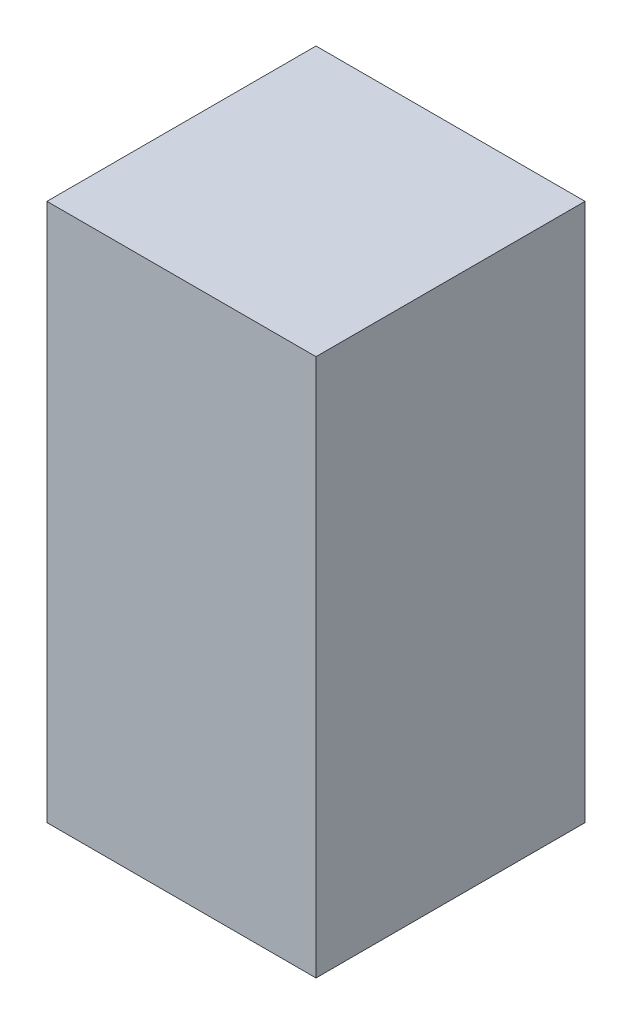
ISO-10303-21;
HEADER;
FILE_DESCRIPTION(('STEP AP214'),'2;1');
FILE_NAME('part.step','',(''),(''),'','','');
FILE_SCHEMA(('AUTOMOTIVE_DESIGN { 1 0 10303 214 1 1 1 1 }'));
ENDSEC;
DATA;
#1=APPLICATION_CONTEXT('core data for automotive mechanical design processes');
#2=APPLICATION_PROTOCOL_DEFINITION('international standard','automotive_design',2000,#1);
#3=PRODUCT_CONTEXT('',#1,'mechanical');
#4=PRODUCT('Part','Part','',(#3));
#5=PRODUCT_RELATED_PRODUCT_CATEGORY('part','',(#4));
#6=PRODUCT_DEFINITION_FORMATION('','',#4);
#7=PRODUCT_DEFINITION_CONTEXT('part definition',#1,'design');
#8=PRODUCT_DEFINITION('design','',#6,#7);
#9=PRODUCT_DEFINITION_SHAPE('','',#8);
#10=(LENGTH_UNIT() NAMED_UNIT(*) SI_UNIT(.MILLI.,.METRE.));
#11=(NAMED_UNIT(*) PLANE_ANGLE_UNIT() SI_UNIT($,.RADIAN.));
#12=(NAMED_UNIT(*) SI_UNIT($,.STERADIAN.) SOLID_ANGLE_UNIT());
#13=UNCERTAINTY_MEASURE_WITH_UNIT(LENGTH_MEASURE(1.E-05),#10,'distance_accuracy_value','');
#14=(GEOMETRIC_REPRESENTATION_CONTEXT(3) GLOBAL_UNCERTAINTY_ASSIGNED_CONTEXT((#13)) GLOBAL_UNIT_ASSIGNED_CONTEXT((#10,
#11,#12)) REPRESENTATION_CONTEXT('',''));
#15=CARTESIAN_POINT('',(0.,0.,0.));
#16=DIRECTION('',(0.,0.,1.));
#17=DIRECTION('',(1.,0.,0.));
#18=AXIS2_PLACEMENT_3D('',#15,#16,#17);
#19=CARTESIAN_POINT('',(0.,400.,0.));
#20=DIRECTION('',(1.,0.,0.));
#21=DIRECTION('',(0.,0.,-1.));
#22=AXIS2_PLACEMENT_3D('',#19,#20,#21);
#23=PLANE('',#22);
#24=DIRECTION('',(0.,0.,1.));
#25=VECTOR('',#24,1.);
#26=CARTESIAN_POINT('',(0.,0.,0.));
#27=LINE('',#26,#25);
#28=CARTESIAN_POINT('',(0.,0.,0.));
#29=VERTEX_POINT('',#28);
#30=CARTESIAN_POINT('',(0.,0.,200.));
#31=VERTEX_POINT('',#30);
#32=EDGE_CURVE('E96',#29,#31,#27,.T.);
#33=ORIENTED_EDGE('',*,*,#32,.T.);
#34=DIRECTION('',(0.,-1.,0.));
#35=VECTOR('',#34,1.);
#36=CARTESIAN_POINT('',(0.,400.,200.));
#37=LINE('',#36,#35);
#38=CARTESIAN_POINT('',(0.,400.,200.));
#39=VERTEX_POINT('',#38);
#40=EDGE_CURVE('E11',#39,#31,#37,.T.);
#41=ORIENTED_EDGE('',*,*,#40,.F.);
#42=DIRECTION('',(0.,0.,1.));
#43=VECTOR('',#42,1.);
#44=CARTESIAN_POINT('',(0.,400.,0.));
#45=LINE('',#44,#43);
#46=CARTESIAN_POINT('',(0.,400.,0.));
#47=VERTEX_POINT('',#46);
#48=EDGE_CURVE('E84',#47,#39,#45,.T.);
#49=ORIENTED_EDGE('',*,*,#48,.F.);
#50=DIRECTION('',(0.,-1.,0.));
#51=VECTOR('',#50,1.);
#52=CARTESIAN_POINT('',(0.,400.,0.));
#53=LINE('',#52,#51);
#54=EDGE_CURVE('E92',#47,#29,#53,.T.);
#55=ORIENTED_EDGE('',*,*,#54,.T.);
#56=EDGE_LOOP('',(#33,#41,#49,#55));
#57=FACE_BOUND('',#56,.T.);
#58=ADVANCED_FACE('F33',(#57),#23,.F.);
#59=CARTESIAN_POINT('',(0.,400.,200.));
#60=DIRECTION('',(0.,0.,-1.));
#61=DIRECTION('',(-1.,0.,0.));
#62=AXIS2_PLACEMENT_3D('',#59,#60,#61);
#63=PLANE('',#62);
#64=DIRECTION('',(1.,0.,0.));
#65=VECTOR('',#64,1.);
#66=CARTESIAN_POINT('',(0.,0.,200.));
#67=LINE('',#66,#65);
#68=CARTESIAN_POINT('',(200.,0.,200.));
#69=VERTEX_POINT('',#68);
#70=EDGE_CURVE('E88',#31,#69,#67,.T.);
#71=ORIENTED_EDGE('',*,*,#70,.T.);
#72=DIRECTION('',(0.,-1.,0.));
#73=VECTOR('',#72,1.);
#74=CARTESIAN_POINT('',(200.,400.,200.));
#75=LINE('',#74,#73);
#76=CARTESIAN_POINT('',(200.,400.,200.));
#77=VERTEX_POINT('',#76);
#78=EDGE_CURVE('E41',#77,#69,#75,.T.);
#79=ORIENTED_EDGE('',*,*,#78,.F.);
#80=DIRECTION('',(1.,0.,0.));
#81=VECTOR('',#80,1.);
#82=CARTESIAN_POINT('',(0.,400.,200.));
#83=LINE('',#82,#81);
#84=EDGE_CURVE('E79',#39,#77,#83,.T.);
#85=ORIENTED_EDGE('',*,*,#84,.F.);
#86=ORIENTED_EDGE('',*,*,#40,.T.);
#87=EDGE_LOOP('',(#71,#79,#85,#86));
#88=FACE_BOUND('',#87,.T.);
#89=ADVANCED_FACE('F87',(#88),#63,.F.);
#90=CARTESIAN_POINT('',(200.,400.,0.));
#91=DIRECTION('',(-1.,0.,0.));
#92=DIRECTION('',(0.,0.,1.));
#93=AXIS2_PLACEMENT_3D('',#90,#91,#92);
#94=PLANE('',#93);
#95=DIRECTION('',(0.,0.,-1.));
#96=VECTOR('',#95,1.);
#97=CARTESIAN_POINT('',(200.,0.,0.));
#98=LINE('',#97,#96);
#99=CARTESIAN_POINT('',(200.,0.,0.));
#100=VERTEX_POINT('',#99);
#101=EDGE_CURVE('E66',#69,#100,#98,.T.);
#102=ORIENTED_EDGE('',*,*,#101,.T.);
#103=DIRECTION('',(0.,-1.,0.));
#104=VECTOR('',#103,1.);
#105=CARTESIAN_POINT('',(200.,400.,0.));
#106=LINE('',#105,#104);
#107=CARTESIAN_POINT('',(200.,400.,0.));
#108=VERTEX_POINT('',#107);
#109=EDGE_CURVE('E89',#108,#100,#106,.T.);
#110=ORIENTED_EDGE('',*,*,#109,.F.);
#111=DIRECTION('',(0.,0.,-1.));
#112=VECTOR('',#111,1.);
#113=CARTESIAN_POINT('',(200.,400.,0.));
#114=LINE('',#113,#112);
#115=EDGE_CURVE('E82',#77,#108,#114,.T.);
#116=ORIENTED_EDGE('',*,*,#115,.F.);
#117=ORIENTED_EDGE('',*,*,#78,.T.);
#118=EDGE_LOOP('',(#102,#110,#116,#117));
#119=FACE_BOUND('',#118,.T.);
#120=ADVANCED_FACE('F90',(#119),#94,.F.);
#121=CARTESIAN_POINT('',(0.,400.,0.));
#122=DIRECTION('',(0.,0.,1.));
#123=DIRECTION('',(1.,0.,0.));
#124=AXIS2_PLACEMENT_3D('',#121,#122,#123);
#125=PLANE('',#124);
#126=DIRECTION('',(-1.,0.,0.));
#127=VECTOR('',#126,1.);
#128=CARTESIAN_POINT('',(0.,0.,0.));
#129=LINE('',#128,#127);
#130=EDGE_CURVE('E72',#100,#29,#129,.T.);
#131=ORIENTED_EDGE('',*,*,#130,.T.);
#132=ORIENTED_EDGE('',*,*,#54,.F.);
#133=DIRECTION('',(-1.,0.,0.));
#134=VECTOR('',#133,1.);
#135=CARTESIAN_POINT('',(0.,400.,0.));
#136=LINE('',#135,#134);
#137=EDGE_CURVE('E49',#108,#47,#136,.T.);
#138=ORIENTED_EDGE('',*,*,#137,.F.);
#139=ORIENTED_EDGE('',*,*,#109,.T.);
#140=EDGE_LOOP('',(#131,#132,#138,#139));
#141=FACE_BOUND('',#140,.T.);
#142=ADVANCED_FACE('F103',(#141),#125,.F.);
#143=CARTESIAN_POINT('',(0.,400.,0.));
#144=DIRECTION('',(0.,1.,0.));
#145=DIRECTION('',(0.,0.,1.));
#146=AXIS2_PLACEMENT_3D('',#143,#144,#145);
#147=PLANE('',#146);
#148=ORIENTED_EDGE('',*,*,#48,.T.);
#149=ORIENTED_EDGE('',*,*,#84,.T.);
#150=ORIENTED_EDGE('',*,*,#115,.T.);
#151=ORIENTED_EDGE('',*,*,#137,.T.);
#152=EDGE_LOOP('',(#148,#149,#150,#151));
#153=FACE_BOUND('',#152,.T.);
#154=ADVANCED_FACE('F80',(#153),#147,.T.);
#155=CARTESIAN_POINT('',(0.,0.,0.));
#156=DIRECTION('',(0.,1.,0.));
#157=DIRECTION('',(0.,0.,1.));
#158=AXIS2_PLACEMENT_3D('',#155,#156,#157);
#159=PLANE('',#158);
#160=ORIENTED_EDGE('',*,*,#32,.F.);
#161=ORIENTED_EDGE('',*,*,#130,.F.);
#162=ORIENTED_EDGE('',*,*,#101,.F.);
#163=ORIENTED_EDGE('',*,*,#70,.F.);
#164=EDGE_LOOP('',(#160,#161,#162,#163));
#165=FACE_BOUND('',#164,.T.);
#166=ADVANCED_FACE('F106',(#165),#159,.F.);
#167=CLOSED_SHELL('',(#58,#89,#120,#142,#154,#166));
#168=MANIFOLD_SOLID_BREP('B2',#167);
#169=ADVANCED_BREP_SHAPE_REPRESENTATION('',(#18,#168),#14);
#170=SHAPE_DEFINITION_REPRESENTATION(#9,#169);
ENDSEC;
END-ISO-10303-21;
